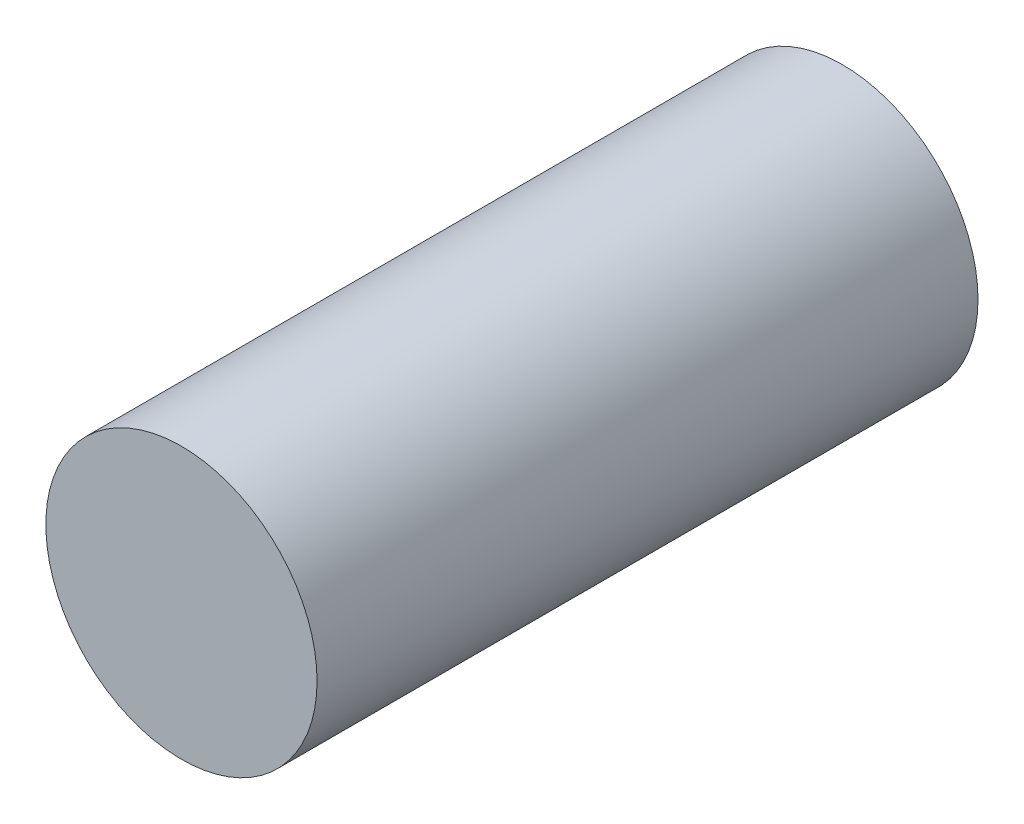
ISO-10303-21;
HEADER;
FILE_DESCRIPTION(('STEP AP214'),'2;1');
FILE_NAME('part.step','',(''),(''),'','','');
FILE_SCHEMA(('AUTOMOTIVE_DESIGN { 1 0 10303 214 1 1 1 1 }'));
ENDSEC;
DATA;
#1=APPLICATION_CONTEXT('core data for automotive mechanical design processes');
#2=APPLICATION_PROTOCOL_DEFINITION('international standard','automotive_design',2000,#1);
#3=PRODUCT_CONTEXT('',#1,'mechanical');
#4=PRODUCT('Part','Part','',(#3));
#5=PRODUCT_RELATED_PRODUCT_CATEGORY('part','',(#4));
#6=PRODUCT_DEFINITION_FORMATION('','',#4);
#7=PRODUCT_DEFINITION_CONTEXT('part definition',#1,'design');
#8=PRODUCT_DEFINITION('design','',#6,#7);
#9=PRODUCT_DEFINITION_SHAPE('','',#8);
#10=(LENGTH_UNIT() NAMED_UNIT(*) SI_UNIT(.MILLI.,.METRE.));
#11=(NAMED_UNIT(*) PLANE_ANGLE_UNIT() SI_UNIT($,.RADIAN.));
#12=(NAMED_UNIT(*) SI_UNIT($,.STERADIAN.) SOLID_ANGLE_UNIT());
#13=UNCERTAINTY_MEASURE_WITH_UNIT(LENGTH_MEASURE(1.E-05),#10,'distance_accuracy_value','');
#14=(GEOMETRIC_REPRESENTATION_CONTEXT(3) GLOBAL_UNCERTAINTY_ASSIGNED_CONTEXT((#13)) GLOBAL_UNIT_ASSIGNED_CONTEXT((#10,
#11,#12)) REPRESENTATION_CONTEXT('',''));
#15=CARTESIAN_POINT('',(0.,0.,0.));
#16=DIRECTION('',(0.,0.,1.));
#17=DIRECTION('',(1.,0.,0.));
#18=AXIS2_PLACEMENT_3D('',#15,#16,#17);
#19=CARTESIAN_POINT('',(-18.4959171765536,12.9398313843873,29.));
#20=DIRECTION('',(0.,0.,-1.));
#21=DIRECTION('',(-1.,0.,0.));
#22=AXIS2_PLACEMENT_3D('',#19,#20,#21);
#23=CYLINDRICAL_SURFACE('',#22,5.95);
#24=CARTESIAN_POINT('',(-18.4959171765536,12.9398313843873,29.));
#25=DIRECTION('',(0.,0.,1.));
#26=DIRECTION('',(1.,0.,0.));
#27=AXIS2_PLACEMENT_3D('',#24,#25,#26);
#28=CIRCLE('',#27,5.95);
#29=CARTESIAN_POINT('',(-12.5459171765536,12.9398313843873,29.));
#30=VERTEX_POINT('',#29);
#31=EDGE_CURVE('E10',#30,#30,#28,.T.);
#32=ORIENTED_EDGE('',*,*,#31,.F.);
#33=EDGE_LOOP('',(#32));
#34=FACE_BOUND('',#33,.T.);
#35=CARTESIAN_POINT('',(-18.4959171765536,12.9398313843873,0.));
#36=DIRECTION('',(0.,0.,1.));
#37=DIRECTION('',(1.,0.,0.));
#38=AXIS2_PLACEMENT_3D('',#35,#36,#37);
#39=CIRCLE('',#38,5.95);
#40=CARTESIAN_POINT('',(-12.5459171765536,12.9398313843873,0.));
#41=VERTEX_POINT('',#40);
#42=EDGE_CURVE('E48',#41,#41,#39,.T.);
#43=ORIENTED_EDGE('',*,*,#42,.T.);
#44=EDGE_LOOP('',(#43));
#45=FACE_BOUND('',#44,.T.);
#46=ADVANCED_FACE('F45',(#34,#45),#23,.T.);
#47=CARTESIAN_POINT('',(-18.4959171765536,12.9398313843873,29.));
#48=DIRECTION('',(0.,0.,1.));
#49=DIRECTION('',(1.,0.,0.));
#50=AXIS2_PLACEMENT_3D('',#47,#48,#49);
#51=PLANE('',#50);
#52=ORIENTED_EDGE('',*,*,#31,.T.);
#53=EDGE_LOOP('',(#52));
#54=FACE_BOUND('',#53,.T.);
#55=ADVANCED_FACE('F64',(#54),#51,.T.);
#56=CARTESIAN_POINT('',(-18.4959171765536,12.9398313843873,0.));
#57=DIRECTION('',(0.,0.,1.));
#58=DIRECTION('',(1.,0.,0.));
#59=AXIS2_PLACEMENT_3D('',#56,#57,#58);
#60=PLANE('',#59);
#61=ORIENTED_EDGE('',*,*,#42,.F.);
#62=EDGE_LOOP('',(#61));
#63=FACE_BOUND('',#62,.T.);
#64=ADVANCED_FACE('F62',(#63),#60,.F.);
#65=CLOSED_SHELL('',(#46,#55,#64));
#66=MANIFOLD_SOLID_BREP('B2',#65);
#67=ADVANCED_BREP_SHAPE_REPRESENTATION('',(#18,#66),#14);
#68=SHAPE_DEFINITION_REPRESENTATION(#9,#67);
ENDSEC;
END-ISO-10303-21;
